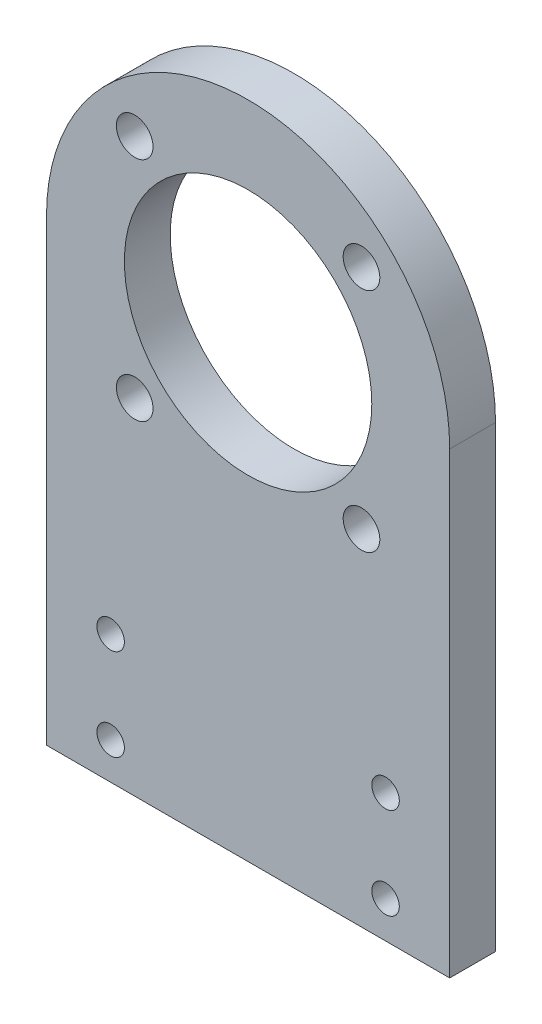
ISO-10303-21;
HEADER;
FILE_DESCRIPTION(('STEP AP214'),'2;1');
FILE_NAME('part.step','',(''),(''),'','','');
FILE_SCHEMA(('AUTOMOTIVE_DESIGN { 1 0 10303 214 1 1 1 1 }'));
ENDSEC;
DATA;
#1=APPLICATION_CONTEXT('core data for automotive mechanical design processes');
#2=APPLICATION_PROTOCOL_DEFINITION('international standard','automotive_design',2000,#1);
#3=PRODUCT_CONTEXT('',#1,'mechanical');
#4=PRODUCT('Part','Part','',(#3));
#5=PRODUCT_RELATED_PRODUCT_CATEGORY('part','',(#4));
#6=PRODUCT_DEFINITION_FORMATION('','',#4);
#7=PRODUCT_DEFINITION_CONTEXT('part definition',#1,'design');
#8=PRODUCT_DEFINITION('design','',#6,#7);
#9=PRODUCT_DEFINITION_SHAPE('','',#8);
#10=(LENGTH_UNIT() NAMED_UNIT(*) SI_UNIT(.MILLI.,.METRE.));
#11=(NAMED_UNIT(*) PLANE_ANGLE_UNIT() SI_UNIT($,.RADIAN.));
#12=(NAMED_UNIT(*) SI_UNIT($,.STERADIAN.) SOLID_ANGLE_UNIT());
#13=UNCERTAINTY_MEASURE_WITH_UNIT(LENGTH_MEASURE(1.E-05),#10,'distance_accuracy_value','');
#14=(GEOMETRIC_REPRESENTATION_CONTEXT(3) GLOBAL_UNCERTAINTY_ASSIGNED_CONTEXT((#13)) GLOBAL_UNIT_ASSIGNED_CONTEXT((#10,
#11,#12)) REPRESENTATION_CONTEXT('',''));
#15=CARTESIAN_POINT('',(0.,0.,0.));
#16=DIRECTION('',(0.,0.,1.));
#17=DIRECTION('',(1.,0.,0.));
#18=AXIS2_PLACEMENT_3D('',#15,#16,#17);
#19=CARTESIAN_POINT('',(1.17961196366423E-13,50.,5.));
#20=DIRECTION('',(0.,0.,1.));
#21=DIRECTION('',(1.,0.,0.));
#22=AXIS2_PLACEMENT_3D('',#19,#20,#21);
#23=PLANE('',#22);
#24=CARTESIAN_POINT('',(-12.3743686707645,37.6256313292355,5.));
#25=DIRECTION('',(0.,0.,-1.));
#26=DIRECTION('',(-1.,0.,0.));
#27=AXIS2_PLACEMENT_3D('',#24,#25,#26);
#28=CIRCLE('',#27,2.);
#29=CARTESIAN_POINT('',(-14.3743686707645,37.6256313292355,5.));
#30=VERTEX_POINT('',#29);
#31=EDGE_CURVE('E148',#30,#30,#28,.T.);
#32=ORIENTED_EDGE('',*,*,#31,.T.);
#33=EDGE_LOOP('',(#32));
#34=FACE_BOUND('',#33,.T.);
#35=CARTESIAN_POINT('',(12.3743686707647,37.6256313292354,5.));
#36=DIRECTION('',(0.,0.,-1.));
#37=DIRECTION('',(-1.,0.,0.));
#38=AXIS2_PLACEMENT_3D('',#35,#36,#37);
#39=CIRCLE('',#38,2.);
#40=CARTESIAN_POINT('',(10.3743686707647,37.6256313292354,5.));
#41=VERTEX_POINT('',#40);
#42=EDGE_CURVE('E160',#41,#41,#39,.T.);
#43=ORIENTED_EDGE('',*,*,#42,.T.);
#44=EDGE_LOOP('',(#43));
#45=FACE_BOUND('',#44,.T.);
#46=CARTESIAN_POINT('',(12.3743686707647,62.3743686707646,5.));
#47=DIRECTION('',(0.,0.,-1.));
#48=DIRECTION('',(-1.,0.,0.));
#49=AXIS2_PLACEMENT_3D('',#46,#47,#48);
#50=CIRCLE('',#49,2.);
#51=CARTESIAN_POINT('',(10.3743686707647,62.3743686707646,5.));
#52=VERTEX_POINT('',#51);
#53=EDGE_CURVE('E154',#52,#52,#50,.T.);
#54=ORIENTED_EDGE('',*,*,#53,.T.);
#55=EDGE_LOOP('',(#54));
#56=FACE_BOUND('',#55,.T.);
#57=CARTESIAN_POINT('',(-12.3743686707644,62.3743686707646,5.));
#58=DIRECTION('',(0.,0.,-1.));
#59=DIRECTION('',(-1.,0.,0.));
#60=AXIS2_PLACEMENT_3D('',#57,#58,#59);
#61=CIRCLE('',#60,2.);
#62=CARTESIAN_POINT('',(-14.3743686707645,62.3743686707646,5.));
#63=VERTEX_POINT('',#62);
#64=EDGE_CURVE('E142',#63,#63,#61,.T.);
#65=ORIENTED_EDGE('',*,*,#64,.T.);
#66=EDGE_LOOP('',(#65));
#67=FACE_BOUND('',#66,.T.);
#68=CARTESIAN_POINT('',(15.,14.,5.));
#69=DIRECTION('',(0.,0.,1.));
#70=DIRECTION('',(-1.,0.,0.));
#71=AXIS2_PLACEMENT_3D('',#68,#69,#70);
#72=CIRCLE('',#71,1.5);
#73=CARTESIAN_POINT('',(13.5,14.,5.));
#74=VERTEX_POINT('',#73);
#75=EDGE_CURVE('E130',#74,#74,#72,.T.);
#76=ORIENTED_EDGE('',*,*,#75,.F.);
#77=EDGE_LOOP('',(#76));
#78=FACE_BOUND('',#77,.T.);
#79=CARTESIAN_POINT('',(-15.,4.,5.));
#80=DIRECTION('',(0.,0.,1.));
#81=DIRECTION('',(1.,0.,0.));
#82=AXIS2_PLACEMENT_3D('',#79,#80,#81);
#83=CIRCLE('',#82,1.5);
#84=CARTESIAN_POINT('',(-13.5,4.,5.));
#85=VERTEX_POINT('',#84);
#86=EDGE_CURVE('E118',#85,#85,#83,.T.);
#87=ORIENTED_EDGE('',*,*,#86,.F.);
#88=EDGE_LOOP('',(#87));
#89=FACE_BOUND('',#88,.T.);
#90=DIRECTION('',(0.,-1.,0.));
#91=VECTOR('',#90,1.);
#92=CARTESIAN_POINT('',(-22.,0.,5.));
#93=LINE('',#92,#91);
#94=CARTESIAN_POINT('',(-21.9999999999999,50.,5.));
#95=VERTEX_POINT('',#94);
#96=CARTESIAN_POINT('',(-22.,0.,5.));
#97=VERTEX_POINT('',#96);
#98=EDGE_CURVE('E88',#95,#97,#93,.T.);
#99=ORIENTED_EDGE('',*,*,#98,.T.);
#100=DIRECTION('',(1.,0.,0.));
#101=VECTOR('',#100,1.);
#102=CARTESIAN_POINT('',(-22.,0.,5.));
#103=LINE('',#102,#101);
#104=CARTESIAN_POINT('',(22.,0.,5.));
#105=VERTEX_POINT('',#104);
#106=EDGE_CURVE('E83',#97,#105,#103,.T.);
#107=ORIENTED_EDGE('',*,*,#106,.T.);
#108=DIRECTION('',(0.,1.,0.));
#109=VECTOR('',#108,1.);
#110=CARTESIAN_POINT('',(22.,0.,5.));
#111=LINE('',#110,#109);
#112=CARTESIAN_POINT('',(22.,50.,5.));
#113=VERTEX_POINT('',#112);
#114=EDGE_CURVE('E86',#105,#113,#111,.T.);
#115=ORIENTED_EDGE('',*,*,#114,.T.);
#116=CARTESIAN_POINT('',(1.17961196366423E-13,50.,5.));
#117=DIRECTION('',(0.,0.,1.));
#118=DIRECTION('',(1.,0.,0.));
#119=AXIS2_PLACEMENT_3D('',#116,#117,#118);
#120=CIRCLE('',#119,22.);
#121=EDGE_CURVE('E53',#113,#95,#120,.T.);
#122=ORIENTED_EDGE('',*,*,#121,.T.);
#123=EDGE_LOOP('',(#99,#107,#115,#122));
#124=FACE_BOUND('',#123,.T.);
#125=CARTESIAN_POINT('',(-15.,14.,5.));
#126=DIRECTION('',(0.,0.,1.));
#127=DIRECTION('',(1.,0.,0.));
#128=AXIS2_PLACEMENT_3D('',#125,#126,#127);
#129=CIRCLE('',#128,1.5);
#130=CARTESIAN_POINT('',(-13.5,14.,5.));
#131=VERTEX_POINT('',#130);
#132=EDGE_CURVE('E103',#131,#131,#129,.T.);
#133=ORIENTED_EDGE('',*,*,#132,.F.);
#134=EDGE_LOOP('',(#133));
#135=FACE_BOUND('',#134,.T.);
#136=CARTESIAN_POINT('',(15.,4.,5.));
#137=DIRECTION('',(0.,0.,1.));
#138=DIRECTION('',(-1.,0.,0.));
#139=AXIS2_PLACEMENT_3D('',#136,#137,#138);
#140=CIRCLE('',#139,1.5);
#141=CARTESIAN_POINT('',(13.5,4.,5.));
#142=VERTEX_POINT('',#141);
#143=EDGE_CURVE('E124',#142,#142,#140,.T.);
#144=ORIENTED_EDGE('',*,*,#143,.F.);
#145=EDGE_LOOP('',(#144));
#146=FACE_BOUND('',#145,.T.);
#147=CARTESIAN_POINT('',(1.17961196366423E-13,50.,5.));
#148=DIRECTION('',(0.,0.,1.));
#149=DIRECTION('',(1.,0.,0.));
#150=AXIS2_PLACEMENT_3D('',#147,#148,#149);
#151=CIRCLE('',#150,13.5);
#152=CARTESIAN_POINT('',(13.5000000000001,50.,5.));
#153=VERTEX_POINT('',#152);
#154=EDGE_CURVE('E136',#153,#153,#151,.T.);
#155=ORIENTED_EDGE('',*,*,#154,.F.);
#156=EDGE_LOOP('',(#155));
#157=FACE_BOUND('',#156,.T.);
#158=ADVANCED_FACE('F36',(#34,#45,#56,#67,#78,#89,#124,#135,#146,#157),#23,.T.);
#159=CARTESIAN_POINT('',(1.17961196366423E-13,50.,0.));
#160=DIRECTION('',(0.,0.,1.));
#161=DIRECTION('',(1.,0.,0.));
#162=AXIS2_PLACEMENT_3D('',#159,#160,#161);
#163=PLANE('',#162);
#164=CARTESIAN_POINT('',(-12.3743686707645,37.6256313292355,0.));
#165=DIRECTION('',(0.,0.,-1.));
#166=DIRECTION('',(-1.,0.,0.));
#167=AXIS2_PLACEMENT_3D('',#164,#165,#166);
#168=CIRCLE('',#167,2.);
#169=CARTESIAN_POINT('',(-14.3743686707645,37.6256313292355,0.));
#170=VERTEX_POINT('',#169);
#171=EDGE_CURVE('E163',#170,#170,#168,.T.);
#172=ORIENTED_EDGE('',*,*,#171,.F.);
#173=EDGE_LOOP('',(#172));
#174=FACE_BOUND('',#173,.T.);
#175=CARTESIAN_POINT('',(12.3743686707647,37.6256313292354,0.));
#176=DIRECTION('',(0.,0.,-1.));
#177=DIRECTION('',(-1.,0.,0.));
#178=AXIS2_PLACEMENT_3D('',#175,#176,#177);
#179=CIRCLE('',#178,2.);
#180=CARTESIAN_POINT('',(10.3743686707647,37.6256313292354,0.));
#181=VERTEX_POINT('',#180);
#182=EDGE_CURVE('E157',#181,#181,#179,.T.);
#183=ORIENTED_EDGE('',*,*,#182,.F.);
#184=EDGE_LOOP('',(#183));
#185=FACE_BOUND('',#184,.T.);
#186=CARTESIAN_POINT('',(12.3743686707647,62.3743686707646,0.));
#187=DIRECTION('',(0.,0.,-1.));
#188=DIRECTION('',(-1.,0.,0.));
#189=AXIS2_PLACEMENT_3D('',#186,#187,#188);
#190=CIRCLE('',#189,2.);
#191=CARTESIAN_POINT('',(10.3743686707647,62.3743686707646,0.));
#192=VERTEX_POINT('',#191);
#193=EDGE_CURVE('E151',#192,#192,#190,.T.);
#194=ORIENTED_EDGE('',*,*,#193,.F.);
#195=EDGE_LOOP('',(#194));
#196=FACE_BOUND('',#195,.T.);
#197=CARTESIAN_POINT('',(-12.3743686707644,62.3743686707646,0.));
#198=DIRECTION('',(0.,0.,-1.));
#199=DIRECTION('',(-1.,0.,0.));
#200=AXIS2_PLACEMENT_3D('',#197,#198,#199);
#201=CIRCLE('',#200,2.);
#202=CARTESIAN_POINT('',(-14.3743686707645,62.3743686707646,0.));
#203=VERTEX_POINT('',#202);
#204=EDGE_CURVE('E145',#203,#203,#201,.T.);
#205=ORIENTED_EDGE('',*,*,#204,.F.);
#206=EDGE_LOOP('',(#205));
#207=FACE_BOUND('',#206,.T.);
#208=DIRECTION('',(0.,-1.,0.));
#209=VECTOR('',#208,1.);
#210=CARTESIAN_POINT('',(-22.,0.,0.));
#211=LINE('',#210,#209);
#212=CARTESIAN_POINT('',(-21.9999999999999,50.,0.));
#213=VERTEX_POINT('',#212);
#214=CARTESIAN_POINT('',(-22.,0.,0.));
#215=VERTEX_POINT('',#214);
#216=EDGE_CURVE('E100',#213,#215,#211,.T.);
#217=ORIENTED_EDGE('',*,*,#216,.F.);
#218=CARTESIAN_POINT('',(1.17961196366423E-13,50.,0.));
#219=DIRECTION('',(0.,0.,1.));
#220=DIRECTION('',(1.,0.,0.));
#221=AXIS2_PLACEMENT_3D('',#218,#219,#220);
#222=CIRCLE('',#221,22.);
#223=CARTESIAN_POINT('',(22.,50.,0.));
#224=VERTEX_POINT('',#223);
#225=EDGE_CURVE('E76',#224,#213,#222,.T.);
#226=ORIENTED_EDGE('',*,*,#225,.F.);
#227=DIRECTION('',(0.,1.,0.));
#228=VECTOR('',#227,1.);
#229=CARTESIAN_POINT('',(22.,0.,0.));
#230=LINE('',#229,#228);
#231=CARTESIAN_POINT('',(22.,0.,0.));
#232=VERTEX_POINT('',#231);
#233=EDGE_CURVE('E70',#232,#224,#230,.T.);
#234=ORIENTED_EDGE('',*,*,#233,.F.);
#235=DIRECTION('',(1.,0.,0.));
#236=VECTOR('',#235,1.);
#237=CARTESIAN_POINT('',(-22.,0.,0.));
#238=LINE('',#237,#236);
#239=EDGE_CURVE('E92',#215,#232,#238,.T.);
#240=ORIENTED_EDGE('',*,*,#239,.F.);
#241=EDGE_LOOP('',(#217,#226,#234,#240));
#242=FACE_BOUND('',#241,.T.);
#243=CARTESIAN_POINT('',(-15.,14.,0.));
#244=DIRECTION('',(0.,0.,1.));
#245=DIRECTION('',(1.,0.,0.));
#246=AXIS2_PLACEMENT_3D('',#243,#244,#245);
#247=CIRCLE('',#246,1.5);
#248=CARTESIAN_POINT('',(-13.5,14.,0.));
#249=VERTEX_POINT('',#248);
#250=EDGE_CURVE('E115',#249,#249,#247,.T.);
#251=ORIENTED_EDGE('',*,*,#250,.T.);
#252=EDGE_LOOP('',(#251));
#253=FACE_BOUND('',#252,.T.);
#254=CARTESIAN_POINT('',(-15.,4.,0.));
#255=DIRECTION('',(0.,0.,1.));
#256=DIRECTION('',(1.,0.,0.));
#257=AXIS2_PLACEMENT_3D('',#254,#255,#256);
#258=CIRCLE('',#257,1.5);
#259=CARTESIAN_POINT('',(-13.5,4.,0.));
#260=VERTEX_POINT('',#259);
#261=EDGE_CURVE('E121',#260,#260,#258,.T.);
#262=ORIENTED_EDGE('',*,*,#261,.T.);
#263=EDGE_LOOP('',(#262));
#264=FACE_BOUND('',#263,.T.);
#265=CARTESIAN_POINT('',(15.,4.,0.));
#266=DIRECTION('',(0.,0.,1.));
#267=DIRECTION('',(-1.,0.,0.));
#268=AXIS2_PLACEMENT_3D('',#265,#266,#267);
#269=CIRCLE('',#268,1.5);
#270=CARTESIAN_POINT('',(13.5,4.,0.));
#271=VERTEX_POINT('',#270);
#272=EDGE_CURVE('E127',#271,#271,#269,.T.);
#273=ORIENTED_EDGE('',*,*,#272,.T.);
#274=EDGE_LOOP('',(#273));
#275=FACE_BOUND('',#274,.T.);
#276=CARTESIAN_POINT('',(15.,14.,0.));
#277=DIRECTION('',(0.,0.,1.));
#278=DIRECTION('',(-1.,0.,0.));
#279=AXIS2_PLACEMENT_3D('',#276,#277,#278);
#280=CIRCLE('',#279,1.5);
#281=CARTESIAN_POINT('',(13.5,14.,0.));
#282=VERTEX_POINT('',#281);
#283=EDGE_CURVE('E133',#282,#282,#280,.T.);
#284=ORIENTED_EDGE('',*,*,#283,.T.);
#285=EDGE_LOOP('',(#284));
#286=FACE_BOUND('',#285,.T.);
#287=CARTESIAN_POINT('',(1.17961196366423E-13,50.,0.));
#288=DIRECTION('',(0.,0.,1.));
#289=DIRECTION('',(1.,0.,0.));
#290=AXIS2_PLACEMENT_3D('',#287,#288,#289);
#291=CIRCLE('',#290,13.5);
#292=CARTESIAN_POINT('',(13.5000000000001,50.,0.));
#293=VERTEX_POINT('',#292);
#294=EDGE_CURVE('E139',#293,#293,#291,.T.);
#295=ORIENTED_EDGE('',*,*,#294,.T.);
#296=EDGE_LOOP('',(#295));
#297=FACE_BOUND('',#296,.T.);
#298=ADVANCED_FACE('F111',(#174,#185,#196,#207,#242,#253,#264,#275,#286,#297),#163,.F.);
#299=CARTESIAN_POINT('',(-22.,0.,5.));
#300=DIRECTION('',(1.,0.,0.));
#301=DIRECTION('',(0.,0.,-1.));
#302=AXIS2_PLACEMENT_3D('',#299,#300,#301);
#303=PLANE('',#302);
#304=ORIENTED_EDGE('',*,*,#216,.T.);
#305=DIRECTION('',(0.,0.,-1.));
#306=VECTOR('',#305,1.);
#307=CARTESIAN_POINT('',(-22.,0.,5.));
#308=LINE('',#307,#306);
#309=EDGE_CURVE('E11',#97,#215,#308,.T.);
#310=ORIENTED_EDGE('',*,*,#309,.F.);
#311=ORIENTED_EDGE('',*,*,#98,.F.);
#312=DIRECTION('',(0.,0.,-1.));
#313=VECTOR('',#312,1.);
#314=CARTESIAN_POINT('',(-21.9999999999999,50.,5.));
#315=LINE('',#314,#313);
#316=EDGE_CURVE('E96',#95,#213,#315,.T.);
#317=ORIENTED_EDGE('',*,*,#316,.T.);
#318=EDGE_LOOP('',(#304,#310,#311,#317));
#319=FACE_BOUND('',#318,.T.);
#320=ADVANCED_FACE('F38',(#319),#303,.F.);
#321=CARTESIAN_POINT('',(-22.,0.,5.));
#322=DIRECTION('',(0.,1.,0.));
#323=DIRECTION('',(-1.,0.,0.));
#324=AXIS2_PLACEMENT_3D('',#321,#322,#323);
#325=PLANE('',#324);
#326=ORIENTED_EDGE('',*,*,#239,.T.);
#327=DIRECTION('',(0.,0.,-1.));
#328=VECTOR('',#327,1.);
#329=CARTESIAN_POINT('',(22.,0.,5.));
#330=LINE('',#329,#328);
#331=EDGE_CURVE('E45',#105,#232,#330,.T.);
#332=ORIENTED_EDGE('',*,*,#331,.F.);
#333=ORIENTED_EDGE('',*,*,#106,.F.);
#334=ORIENTED_EDGE('',*,*,#309,.T.);
#335=EDGE_LOOP('',(#326,#332,#333,#334));
#336=FACE_BOUND('',#335,.T.);
#337=ADVANCED_FACE('F91',(#336),#325,.F.);
#338=CARTESIAN_POINT('',(22.,0.,5.));
#339=DIRECTION('',(-1.,0.,0.));
#340=DIRECTION('',(0.,-1.,0.));
#341=AXIS2_PLACEMENT_3D('',#338,#339,#340);
#342=PLANE('',#341);
#343=ORIENTED_EDGE('',*,*,#233,.T.);
#344=DIRECTION('',(0.,0.,-1.));
#345=VECTOR('',#344,1.);
#346=CARTESIAN_POINT('',(22.,50.,5.));
#347=LINE('',#346,#345);
#348=EDGE_CURVE('E93',#113,#224,#347,.T.);
#349=ORIENTED_EDGE('',*,*,#348,.F.);
#350=ORIENTED_EDGE('',*,*,#114,.F.);
#351=ORIENTED_EDGE('',*,*,#331,.T.);
#352=EDGE_LOOP('',(#343,#349,#350,#351));
#353=FACE_BOUND('',#352,.T.);
#354=ADVANCED_FACE('F94',(#353),#342,.F.);
#355=CARTESIAN_POINT('',(1.17961196366423E-13,50.,5.));
#356=DIRECTION('',(0.,0.,-1.));
#357=DIRECTION('',(-1.,0.,0.));
#358=AXIS2_PLACEMENT_3D('',#355,#356,#357);
#359=CYLINDRICAL_SURFACE('',#358,22.);
#360=ORIENTED_EDGE('',*,*,#225,.T.);
#361=ORIENTED_EDGE('',*,*,#316,.F.);
#362=ORIENTED_EDGE('',*,*,#121,.F.);
#363=ORIENTED_EDGE('',*,*,#348,.T.);
#364=EDGE_LOOP('',(#360,#361,#362,#363));
#365=FACE_BOUND('',#364,.T.);
#366=ADVANCED_FACE('F108',(#365),#359,.T.);
#367=CARTESIAN_POINT('',(-15.,14.,5.));
#368=DIRECTION('',(0.,0.,-1.));
#369=DIRECTION('',(-1.,0.,0.));
#370=AXIS2_PLACEMENT_3D('',#367,#368,#369);
#371=CYLINDRICAL_SURFACE('',#370,1.5);
#372=ORIENTED_EDGE('',*,*,#132,.T.);
#373=EDGE_LOOP('',(#372));
#374=FACE_BOUND('',#373,.T.);
#375=ORIENTED_EDGE('',*,*,#250,.F.);
#376=EDGE_LOOP('',(#375));
#377=FACE_BOUND('',#376,.T.);
#378=ADVANCED_FACE('F208',(#374,#377),#371,.F.);
#379=CARTESIAN_POINT('',(-15.,4.,5.));
#380=DIRECTION('',(0.,0.,-1.));
#381=DIRECTION('',(-1.,0.,0.));
#382=AXIS2_PLACEMENT_3D('',#379,#380,#381);
#383=CYLINDRICAL_SURFACE('',#382,1.5);
#384=ORIENTED_EDGE('',*,*,#86,.T.);
#385=EDGE_LOOP('',(#384));
#386=FACE_BOUND('',#385,.T.);
#387=ORIENTED_EDGE('',*,*,#261,.F.);
#388=EDGE_LOOP('',(#387));
#389=FACE_BOUND('',#388,.T.);
#390=ADVANCED_FACE('F267',(#386,#389),#383,.F.);
#391=CARTESIAN_POINT('',(15.,4.,5.));
#392=DIRECTION('',(0.,0.,-1.));
#393=DIRECTION('',(-1.,0.,0.));
#394=AXIS2_PLACEMENT_3D('',#391,#392,#393);
#395=CYLINDRICAL_SURFACE('',#394,1.5);
#396=ORIENTED_EDGE('',*,*,#143,.T.);
#397=EDGE_LOOP('',(#396));
#398=FACE_BOUND('',#397,.T.);
#399=ORIENTED_EDGE('',*,*,#272,.F.);
#400=EDGE_LOOP('',(#399));
#401=FACE_BOUND('',#400,.T.);
#402=ADVANCED_FACE('F270',(#398,#401),#395,.F.);
#403=CARTESIAN_POINT('',(15.,14.,5.));
#404=DIRECTION('',(0.,0.,-1.));
#405=DIRECTION('',(-1.,0.,0.));
#406=AXIS2_PLACEMENT_3D('',#403,#404,#405);
#407=CYLINDRICAL_SURFACE('',#406,1.5);
#408=ORIENTED_EDGE('',*,*,#75,.T.);
#409=EDGE_LOOP('',(#408));
#410=FACE_BOUND('',#409,.T.);
#411=ORIENTED_EDGE('',*,*,#283,.F.);
#412=EDGE_LOOP('',(#411));
#413=FACE_BOUND('',#412,.T.);
#414=ADVANCED_FACE('F199',(#410,#413),#407,.F.);
#415=CARTESIAN_POINT('',(1.17961196366423E-13,50.,5.));
#416=DIRECTION('',(0.,0.,-1.));
#417=DIRECTION('',(-1.,0.,0.));
#418=AXIS2_PLACEMENT_3D('',#415,#416,#417);
#419=CYLINDRICAL_SURFACE('',#418,13.5);
#420=ORIENTED_EDGE('',*,*,#154,.T.);
#421=EDGE_LOOP('',(#420));
#422=FACE_BOUND('',#421,.T.);
#423=ORIENTED_EDGE('',*,*,#294,.F.);
#424=EDGE_LOOP('',(#423));
#425=FACE_BOUND('',#424,.T.);
#426=ADVANCED_FACE('F190',(#422,#425),#419,.F.);
#427=CARTESIAN_POINT('',(-12.3743686707644,62.3743686707646,5.));
#428=DIRECTION('',(0.,0.,-1.));
#429=DIRECTION('',(-1.,0.,0.));
#430=AXIS2_PLACEMENT_3D('',#427,#428,#429);
#431=CYLINDRICAL_SURFACE('',#430,2.);
#432=ORIENTED_EDGE('',*,*,#64,.F.);
#433=EDGE_LOOP('',(#432));
#434=FACE_BOUND('',#433,.T.);
#435=ORIENTED_EDGE('',*,*,#204,.T.);
#436=EDGE_LOOP('',(#435));
#437=FACE_BOUND('',#436,.T.);
#438=ADVANCED_FACE('F187',(#434,#437),#431,.F.);
#439=CARTESIAN_POINT('',(12.3743686707647,62.3743686707646,5.));
#440=DIRECTION('',(0.,0.,-1.));
#441=DIRECTION('',(-1.,0.,0.));
#442=AXIS2_PLACEMENT_3D('',#439,#440,#441);
#443=CYLINDRICAL_SURFACE('',#442,2.);
#444=ORIENTED_EDGE('',*,*,#53,.F.);
#445=EDGE_LOOP('',(#444));
#446=FACE_BOUND('',#445,.T.);
#447=ORIENTED_EDGE('',*,*,#193,.T.);
#448=EDGE_LOOP('',(#447));
#449=FACE_BOUND('',#448,.T.);
#450=ADVANCED_FACE('F189',(#446,#449),#443,.F.);
#451=CARTESIAN_POINT('',(12.3743686707647,37.6256313292354,5.));
#452=DIRECTION('',(0.,0.,-1.));
#453=DIRECTION('',(-1.,0.,0.));
#454=AXIS2_PLACEMENT_3D('',#451,#452,#453);
#455=CYLINDRICAL_SURFACE('',#454,2.);
#456=ORIENTED_EDGE('',*,*,#42,.F.);
#457=EDGE_LOOP('',(#456));
#458=FACE_BOUND('',#457,.T.);
#459=ORIENTED_EDGE('',*,*,#182,.T.);
#460=EDGE_LOOP('',(#459));
#461=FACE_BOUND('',#460,.T.);
#462=ADVANCED_FACE('F174',(#458,#461),#455,.F.);
#463=CARTESIAN_POINT('',(-12.3743686707645,37.6256313292355,5.));
#464=DIRECTION('',(0.,0.,-1.));
#465=DIRECTION('',(-1.,0.,0.));
#466=AXIS2_PLACEMENT_3D('',#463,#464,#465);
#467=CYLINDRICAL_SURFACE('',#466,2.);
#468=ORIENTED_EDGE('',*,*,#31,.F.);
#469=EDGE_LOOP('',(#468));
#470=FACE_BOUND('',#469,.T.);
#471=ORIENTED_EDGE('',*,*,#171,.T.);
#472=EDGE_LOOP('',(#471));
#473=FACE_BOUND('',#472,.T.);
#474=ADVANCED_FACE('F171',(#470,#473),#467,.F.);
#475=CLOSED_SHELL('',(#158,#298,#320,#337,#354,#366,#378,#390,#402,#414,#426,#438,#450,#462,#474));
#476=MANIFOLD_SOLID_BREP('B2',#475);
#477=ADVANCED_BREP_SHAPE_REPRESENTATION('',(#18,#476),#14);
#478=SHAPE_DEFINITION_REPRESENTATION(#9,#477);
ENDSEC;
END-ISO-10303-21;
